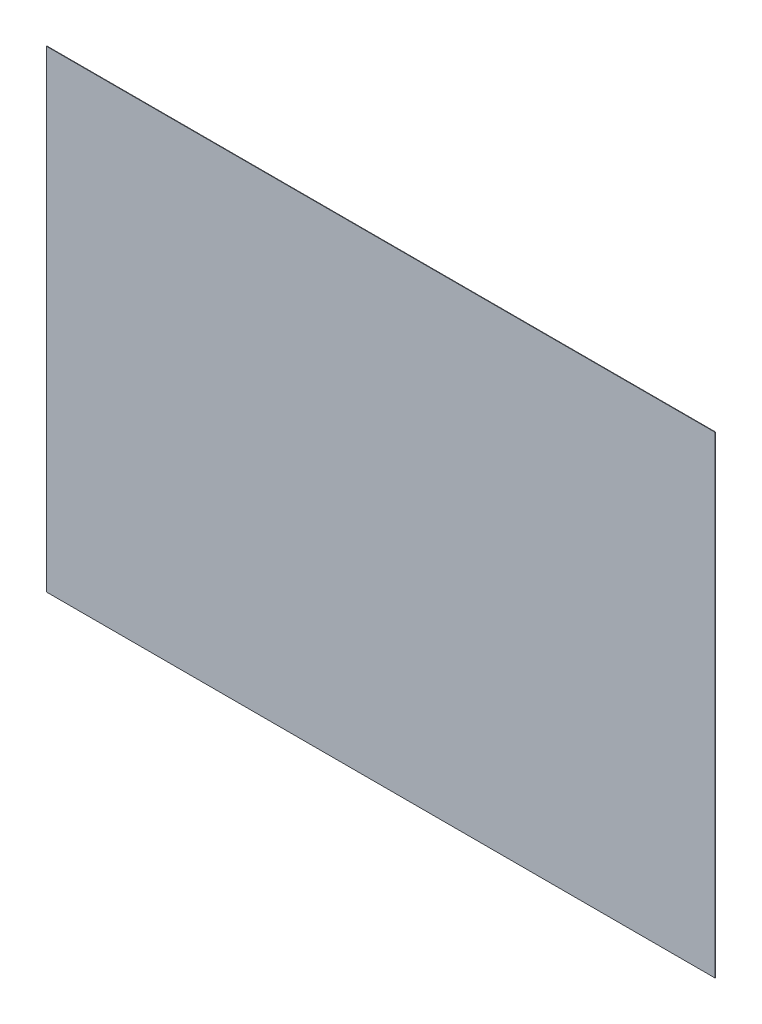
ISO-10303-21;
HEADER;
FILE_DESCRIPTION(('STEP AP214'),'2;1');
FILE_NAME('part.step','',(''),(''),'','','');
FILE_SCHEMA(('AUTOMOTIVE_DESIGN { 1 0 10303 214 1 1 1 1 }'));
ENDSEC;
DATA;
#1=APPLICATION_CONTEXT('core data for automotive mechanical design processes');
#2=APPLICATION_PROTOCOL_DEFINITION('international standard','automotive_design',2000,#1);
#3=PRODUCT_CONTEXT('',#1,'mechanical');
#4=PRODUCT('Part','Part','',(#3));
#5=PRODUCT_RELATED_PRODUCT_CATEGORY('part','',(#4));
#6=PRODUCT_DEFINITION_FORMATION('','',#4);
#7=PRODUCT_DEFINITION_CONTEXT('part definition',#1,'design');
#8=PRODUCT_DEFINITION('design','',#6,#7);
#9=PRODUCT_DEFINITION_SHAPE('','',#8);
#10=(LENGTH_UNIT() NAMED_UNIT(*) SI_UNIT(.MILLI.,.METRE.));
#11=(NAMED_UNIT(*) PLANE_ANGLE_UNIT() SI_UNIT($,.RADIAN.));
#12=(NAMED_UNIT(*) SI_UNIT($,.STERADIAN.) SOLID_ANGLE_UNIT());
#13=UNCERTAINTY_MEASURE_WITH_UNIT(LENGTH_MEASURE(1.E-05),#10,'distance_accuracy_value','');
#14=(GEOMETRIC_REPRESENTATION_CONTEXT(3) GLOBAL_UNCERTAINTY_ASSIGNED_CONTEXT((#13)) GLOBAL_UNIT_ASSIGNED_CONTEXT((#10,
#11,#12)) REPRESENTATION_CONTEXT('',''));
#15=CARTESIAN_POINT('',(0.,0.,0.));
#16=DIRECTION('',(0.,0.,1.));
#17=DIRECTION('',(1.,0.,0.));
#18=AXIS2_PLACEMENT_3D('',#15,#16,#17);
#19=CARTESIAN_POINT('',(-210.,-148.5,0.3));
#20=DIRECTION('',(1.,0.,0.));
#21=DIRECTION('',(0.,0.,-1.));
#22=AXIS2_PLACEMENT_3D('',#19,#20,#21);
#23=PLANE('',#22);
#24=DIRECTION('',(0.,-1.,0.));
#25=VECTOR('',#24,1.);
#26=CARTESIAN_POINT('',(-210.,-148.5,0.));
#27=LINE('',#26,#25);
#28=CARTESIAN_POINT('',(-210.,148.5,0.));
#29=VERTEX_POINT('',#28);
#30=CARTESIAN_POINT('',(-210.,-148.5,0.));
#31=VERTEX_POINT('',#30);
#32=EDGE_CURVE('E98',#29,#31,#27,.T.);
#33=ORIENTED_EDGE('',*,*,#32,.T.);
#34=DIRECTION('',(0.,0.,-1.));
#35=VECTOR('',#34,1.);
#36=CARTESIAN_POINT('',(-210.,-148.5,0.3));
#37=LINE('',#36,#35);
#38=CARTESIAN_POINT('',(-210.,-148.5,0.3));
#39=VERTEX_POINT('',#38);
#40=EDGE_CURVE('E11',#39,#31,#37,.T.);
#41=ORIENTED_EDGE('',*,*,#40,.F.);
#42=DIRECTION('',(0.,-1.,0.));
#43=VECTOR('',#42,1.);
#44=CARTESIAN_POINT('',(-210.,-148.5,0.3));
#45=LINE('',#44,#43);
#46=CARTESIAN_POINT('',(-210.,148.5,0.3));
#47=VERTEX_POINT('',#46);
#48=EDGE_CURVE('E86',#47,#39,#45,.T.);
#49=ORIENTED_EDGE('',*,*,#48,.F.);
#50=DIRECTION('',(0.,0.,-1.));
#51=VECTOR('',#50,1.);
#52=CARTESIAN_POINT('',(-210.,148.5,0.3));
#53=LINE('',#52,#51);
#54=EDGE_CURVE('E94',#47,#29,#53,.T.);
#55=ORIENTED_EDGE('',*,*,#54,.T.);
#56=EDGE_LOOP('',(#33,#41,#49,#55));
#57=FACE_BOUND('',#56,.T.);
#58=ADVANCED_FACE('F35',(#57),#23,.F.);
#59=CARTESIAN_POINT('',(210.,-148.5,0.3));
#60=DIRECTION('',(0.,1.,0.));
#61=DIRECTION('',(-1.,0.,0.));
#62=AXIS2_PLACEMENT_3D('',#59,#60,#61);
#63=PLANE('',#62);
#64=DIRECTION('',(1.,0.,0.));
#65=VECTOR('',#64,1.);
#66=CARTESIAN_POINT('',(210.,-148.5,0.));
#67=LINE('',#66,#65);
#68=CARTESIAN_POINT('',(210.,-148.5,0.));
#69=VERTEX_POINT('',#68);
#70=EDGE_CURVE('E90',#31,#69,#67,.T.);
#71=ORIENTED_EDGE('',*,*,#70,.T.);
#72=DIRECTION('',(0.,0.,-1.));
#73=VECTOR('',#72,1.);
#74=CARTESIAN_POINT('',(210.,-148.5,0.3));
#75=LINE('',#74,#73);
#76=CARTESIAN_POINT('',(210.,-148.5,0.3));
#77=VERTEX_POINT('',#76);
#78=EDGE_CURVE('E43',#77,#69,#75,.T.);
#79=ORIENTED_EDGE('',*,*,#78,.F.);
#80=DIRECTION('',(1.,0.,0.));
#81=VECTOR('',#80,1.);
#82=CARTESIAN_POINT('',(210.,-148.5,0.3));
#83=LINE('',#82,#81);
#84=EDGE_CURVE('E81',#39,#77,#83,.T.);
#85=ORIENTED_EDGE('',*,*,#84,.F.);
#86=ORIENTED_EDGE('',*,*,#40,.T.);
#87=EDGE_LOOP('',(#71,#79,#85,#86));
#88=FACE_BOUND('',#87,.T.);
#89=ADVANCED_FACE('F89',(#88),#63,.F.);
#90=CARTESIAN_POINT('',(210.,-148.5,0.3));
#91=DIRECTION('',(-1.,0.,0.));
#92=DIRECTION('',(0.,0.,1.));
#93=AXIS2_PLACEMENT_3D('',#90,#91,#92);
#94=PLANE('',#93);
#95=DIRECTION('',(0.,1.,0.));
#96=VECTOR('',#95,1.);
#97=CARTESIAN_POINT('',(210.,-148.5,0.));
#98=LINE('',#97,#96);
#99=CARTESIAN_POINT('',(210.,148.5,0.));
#100=VERTEX_POINT('',#99);
#101=EDGE_CURVE('E68',#69,#100,#98,.T.);
#102=ORIENTED_EDGE('',*,*,#101,.T.);
#103=DIRECTION('',(0.,0.,-1.));
#104=VECTOR('',#103,1.);
#105=CARTESIAN_POINT('',(210.,148.5,0.3));
#106=LINE('',#105,#104);
#107=CARTESIAN_POINT('',(210.,148.5,0.3));
#108=VERTEX_POINT('',#107);
#109=EDGE_CURVE('E91',#108,#100,#106,.T.);
#110=ORIENTED_EDGE('',*,*,#109,.F.);
#111=DIRECTION('',(0.,1.,0.));
#112=VECTOR('',#111,1.);
#113=CARTESIAN_POINT('',(210.,-148.5,0.3));
#114=LINE('',#113,#112);
#115=EDGE_CURVE('E84',#77,#108,#114,.T.);
#116=ORIENTED_EDGE('',*,*,#115,.F.);
#117=ORIENTED_EDGE('',*,*,#78,.T.);
#118=EDGE_LOOP('',(#102,#110,#116,#117));
#119=FACE_BOUND('',#118,.T.);
#120=ADVANCED_FACE('F92',(#119),#94,.F.);
#121=CARTESIAN_POINT('',(210.,148.5,0.3));
#122=DIRECTION('',(0.,-1.,0.));
#123=DIRECTION('',(1.,0.,0.));
#124=AXIS2_PLACEMENT_3D('',#121,#122,#123);
#125=PLANE('',#124);
#126=DIRECTION('',(-1.,0.,0.));
#127=VECTOR('',#126,1.);
#128=CARTESIAN_POINT('',(210.,148.5,0.));
#129=LINE('',#128,#127);
#130=EDGE_CURVE('E74',#100,#29,#129,.T.);
#131=ORIENTED_EDGE('',*,*,#130,.T.);
#132=ORIENTED_EDGE('',*,*,#54,.F.);
#133=DIRECTION('',(-1.,0.,0.));
#134=VECTOR('',#133,1.);
#135=CARTESIAN_POINT('',(210.,148.5,0.3));
#136=LINE('',#135,#134);
#137=EDGE_CURVE('E51',#108,#47,#136,.T.);
#138=ORIENTED_EDGE('',*,*,#137,.F.);
#139=ORIENTED_EDGE('',*,*,#109,.T.);
#140=EDGE_LOOP('',(#131,#132,#138,#139));
#141=FACE_BOUND('',#140,.T.);
#142=ADVANCED_FACE('F105',(#141),#125,.F.);
#143=CARTESIAN_POINT('',(0.,0.,0.3));
#144=DIRECTION('',(0.,0.,1.));
#145=DIRECTION('',(1.,0.,0.));
#146=AXIS2_PLACEMENT_3D('',#143,#144,#145);
#147=PLANE('',#146);
#148=ORIENTED_EDGE('',*,*,#48,.T.);
#149=ORIENTED_EDGE('',*,*,#84,.T.);
#150=ORIENTED_EDGE('',*,*,#115,.T.);
#151=ORIENTED_EDGE('',*,*,#137,.T.);
#152=EDGE_LOOP('',(#148,#149,#150,#151));
#153=FACE_BOUND('',#152,.T.);
#154=ADVANCED_FACE('F82',(#153),#147,.T.);
#155=CARTESIAN_POINT('',(0.,0.,0.));
#156=DIRECTION('',(0.,0.,1.));
#157=DIRECTION('',(1.,0.,0.));
#158=AXIS2_PLACEMENT_3D('',#155,#156,#157);
#159=PLANE('',#158);
#160=ORIENTED_EDGE('',*,*,#32,.F.);
#161=ORIENTED_EDGE('',*,*,#130,.F.);
#162=ORIENTED_EDGE('',*,*,#101,.F.);
#163=ORIENTED_EDGE('',*,*,#70,.F.);
#164=EDGE_LOOP('',(#160,#161,#162,#163));
#165=FACE_BOUND('',#164,.T.);
#166=ADVANCED_FACE('F108',(#165),#159,.F.);
#167=CLOSED_SHELL('',(#58,#89,#120,#142,#154,#166));
#168=MANIFOLD_SOLID_BREP('B2',#167);
#169=ADVANCED_BREP_SHAPE_REPRESENTATION('',(#18,#168),#14);
#170=SHAPE_DEFINITION_REPRESENTATION(#9,#169);
ENDSEC;
END-ISO-10303-21;
